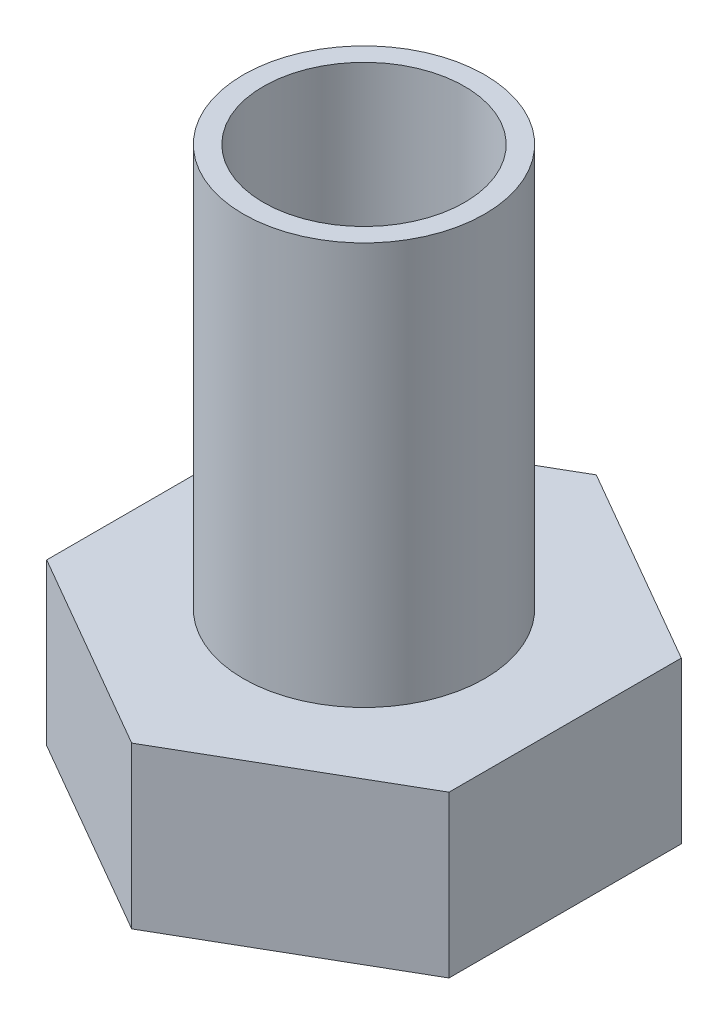
ISO-10303-21;
HEADER;
FILE_DESCRIPTION(('STEP AP214'),'2;1');
FILE_NAME('part.step','',(''),(''),'','','');
FILE_SCHEMA(('AUTOMOTIVE_DESIGN { 1 0 10303 214 1 1 1 1 }'));
ENDSEC;
DATA;
#1=APPLICATION_CONTEXT('core data for automotive mechanical design processes');
#2=APPLICATION_PROTOCOL_DEFINITION('international standard','automotive_design',2000,#1);
#3=PRODUCT_CONTEXT('',#1,'mechanical');
#4=PRODUCT('Part','Part','',(#3));
#5=PRODUCT_RELATED_PRODUCT_CATEGORY('part','',(#4));
#6=PRODUCT_DEFINITION_FORMATION('','',#4);
#7=PRODUCT_DEFINITION_CONTEXT('part definition',#1,'design');
#8=PRODUCT_DEFINITION('design','',#6,#7);
#9=PRODUCT_DEFINITION_SHAPE('','',#8);
#10=(LENGTH_UNIT() NAMED_UNIT(*) SI_UNIT(.MILLI.,.METRE.));
#11=(NAMED_UNIT(*) PLANE_ANGLE_UNIT() SI_UNIT($,.RADIAN.));
#12=(NAMED_UNIT(*) SI_UNIT($,.STERADIAN.) SOLID_ANGLE_UNIT());
#13=UNCERTAINTY_MEASURE_WITH_UNIT(LENGTH_MEASURE(1.E-05),#10,'distance_accuracy_value','');
#14=(GEOMETRIC_REPRESENTATION_CONTEXT(3) GLOBAL_UNCERTAINTY_ASSIGNED_CONTEXT((#13)) GLOBAL_UNIT_ASSIGNED_CONTEXT((#10,
#11,#12)) REPRESENTATION_CONTEXT('',''));
#15=CARTESIAN_POINT('',(0.,0.,0.));
#16=DIRECTION('',(0.,0.,1.));
#17=DIRECTION('',(1.,0.,0.));
#18=AXIS2_PLACEMENT_3D('',#15,#16,#17);
#19=CARTESIAN_POINT('',(0.,10.,0.));
#20=DIRECTION('',(0.,1.,0.));
#21=DIRECTION('',(0.,0.,1.));
#22=AXIS2_PLACEMENT_3D('',#19,#20,#21);
#23=PLANE('',#22);
#24=CARTESIAN_POINT('',(0.,10.,0.));
#25=DIRECTION('',(0.,1.,0.));
#26=DIRECTION('',(0.,0.,1.));
#27=AXIS2_PLACEMENT_3D('',#24,#25,#26);
#28=CIRCLE('',#27,3.);
#29=CARTESIAN_POINT('',(0.,10.,3.));
#30=VERTEX_POINT('',#29);
#31=EDGE_CURVE('E11',#30,#30,#28,.T.);
#32=ORIENTED_EDGE('',*,*,#31,.T.);
#33=EDGE_LOOP('',(#32));
#34=FACE_BOUND('',#33,.T.);
#35=CARTESIAN_POINT('',(0.,10.,0.));
#36=DIRECTION('',(0.,1.,0.));
#37=DIRECTION('',(0.,0.,1.));
#38=AXIS2_PLACEMENT_3D('',#35,#36,#37);
#39=CIRCLE('',#38,2.5);
#40=CARTESIAN_POINT('',(0.,10.,2.5));
#41=VERTEX_POINT('',#40);
#42=EDGE_CURVE('E42',#41,#41,#39,.T.);
#43=ORIENTED_EDGE('',*,*,#42,.F.);
#44=EDGE_LOOP('',(#43));
#45=FACE_BOUND('',#44,.T.);
#46=ADVANCED_FACE('F33',(#34,#45),#23,.T.);
#47=CARTESIAN_POINT('',(0.,10.,0.));
#48=DIRECTION('',(0.,-1.,0.));
#49=DIRECTION('',(0.,0.,-1.));
#50=AXIS2_PLACEMENT_3D('',#47,#48,#49);
#51=CYLINDRICAL_SURFACE('',#50,3.);
#52=ORIENTED_EDGE('',*,*,#31,.F.);
#53=EDGE_LOOP('',(#52));
#54=FACE_BOUND('',#53,.T.);
#55=CARTESIAN_POINT('',(0.,0.,0.));
#56=DIRECTION('',(0.,-1.,0.));
#57=DIRECTION('',(0.,0.,-1.));
#58=AXIS2_PLACEMENT_3D('',#55,#56,#57);
#59=CIRCLE('',#58,3.);
#60=CARTESIAN_POINT('',(0.,0.,-3.));
#61=VERTEX_POINT('',#60);
#62=EDGE_CURVE('E138',#61,#61,#59,.T.);
#63=ORIENTED_EDGE('',*,*,#62,.F.);
#64=EDGE_LOOP('',(#63));
#65=FACE_BOUND('',#64,.T.);
#66=ADVANCED_FACE('F35',(#54,#65),#51,.T.);
#67=CARTESIAN_POINT('',(0.,10.,0.));
#68=DIRECTION('',(0.,-1.,0.));
#69=DIRECTION('',(0.,0.,-1.));
#70=AXIS2_PLACEMENT_3D('',#67,#68,#69);
#71=CYLINDRICAL_SURFACE('',#70,2.5);
#72=ORIENTED_EDGE('',*,*,#42,.T.);
#73=EDGE_LOOP('',(#72));
#74=FACE_BOUND('',#73,.T.);
#75=CARTESIAN_POINT('',(0.,0.,0.));
#76=DIRECTION('',(0.,1.,0.));
#77=DIRECTION('',(0.,0.,1.));
#78=AXIS2_PLACEMENT_3D('',#75,#76,#77);
#79=CIRCLE('',#78,2.5);
#80=CARTESIAN_POINT('',(0.,0.,2.5));
#81=VERTEX_POINT('',#80);
#82=EDGE_CURVE('E141',#81,#81,#79,.T.);
#83=ORIENTED_EDGE('',*,*,#82,.F.);
#84=EDGE_LOOP('',(#83));
#85=FACE_BOUND('',#84,.T.);
#86=ADVANCED_FACE('F148',(#74,#85),#71,.F.);
#87=CARTESIAN_POINT('',(0.,0.,0.));
#88=DIRECTION('',(0.,-1.,0.));
#89=DIRECTION('',(0.,0.,-1.));
#90=AXIS2_PLACEMENT_3D('',#87,#88,#89);
#91=PLANE('',#90);
#92=ORIENTED_EDGE('',*,*,#82,.T.);
#93=EDGE_LOOP('',(#92));
#94=FACE_BOUND('',#93,.T.);
#95=ADVANCED_FACE('F146',(#94),#91,.F.);
#96=DIRECTION('',(-0.866025403784439,0.,0.5));
#97=VECTOR('',#96,1.);
#98=CARTESIAN_POINT('',(4.99999999999999,0.,2.88675134594813));
#99=LINE('',#98,#97);
#100=CARTESIAN_POINT('',(4.99999999999999,0.,2.88675134594813));
#101=VERTEX_POINT('',#100);
#102=CARTESIAN_POINT('',(0.,0.,5.77350269189626));
#103=VERTEX_POINT('',#102);
#104=EDGE_CURVE('E119',#101,#103,#99,.T.);
#105=ORIENTED_EDGE('',*,*,#104,.F.);
#106=DIRECTION('',(0.,0.,1.));
#107=VECTOR('',#106,1.);
#108=CARTESIAN_POINT('',(5.,0.,-2.88675134594813));
#109=LINE('',#108,#107);
#110=CARTESIAN_POINT('',(5.,0.,-2.88675134594813));
#111=VERTEX_POINT('',#110);
#112=EDGE_CURVE('E79',#111,#101,#109,.T.);
#113=ORIENTED_EDGE('',*,*,#112,.F.);
#114=DIRECTION('',(0.866025403784439,0.,0.5));
#115=VECTOR('',#114,1.);
#116=CARTESIAN_POINT('',(0.,0.,-5.77350269189626));
#117=LINE('',#116,#115);
#118=CARTESIAN_POINT('',(0.,0.,-5.77350269189626));
#119=VERTEX_POINT('',#118);
#120=EDGE_CURVE('E73',#119,#111,#117,.T.);
#121=ORIENTED_EDGE('',*,*,#120,.F.);
#122=DIRECTION('',(0.866025403784439,0.,-0.5));
#123=VECTOR('',#122,1.);
#124=CARTESIAN_POINT('',(-5.,0.,-2.88675134594813));
#125=LINE('',#124,#123);
#126=CARTESIAN_POINT('',(-5.,0.,-2.88675134594813));
#127=VERTEX_POINT('',#126);
#128=EDGE_CURVE('E109',#127,#119,#125,.T.);
#129=ORIENTED_EDGE('',*,*,#128,.F.);
#130=DIRECTION('',(0.,0.,-1.));
#131=VECTOR('',#130,1.);
#132=CARTESIAN_POINT('',(-5.,0.,2.88675134594813));
#133=LINE('',#132,#131);
#134=CARTESIAN_POINT('',(-5.,0.,2.88675134594813));
#135=VERTEX_POINT('',#134);
#136=EDGE_CURVE('E124',#135,#127,#133,.T.);
#137=ORIENTED_EDGE('',*,*,#136,.F.);
#138=DIRECTION('',(-0.866025403784439,0.,-0.5));
#139=VECTOR('',#138,1.);
#140=CARTESIAN_POINT('',(0.,0.,5.77350269189626));
#141=LINE('',#140,#139);
#142=EDGE_CURVE('E122',#103,#135,#141,.T.);
#143=ORIENTED_EDGE('',*,*,#142,.F.);
#144=EDGE_LOOP('',(#105,#113,#121,#129,#137,#143));
#145=FACE_BOUND('',#144,.T.);
#146=ORIENTED_EDGE('',*,*,#62,.T.);
#147=EDGE_LOOP('',(#146));
#148=FACE_BOUND('',#147,.T.);
#149=ADVANCED_FACE('F156',(#145,#148),#91,.F.);
#150=CARTESIAN_POINT('',(4.99999999999999,-4.,2.88675134594813));
#151=DIRECTION('',(-0.5,0.,-0.866025403784439));
#152=DIRECTION('',(-0.866025403784439,0.,0.5));
#153=AXIS2_PLACEMENT_3D('',#150,#151,#152);
#154=PLANE('',#153);
#155=ORIENTED_EDGE('',*,*,#104,.T.);
#156=DIRECTION('',(0.,1.,0.));
#157=VECTOR('',#156,1.);
#158=CARTESIAN_POINT('',(0.,-4.,5.77350269189626));
#159=LINE('',#158,#157);
#160=CARTESIAN_POINT('',(0.,-4.,5.77350269189626));
#161=VERTEX_POINT('',#160);
#162=EDGE_CURVE('E136',#161,#103,#159,.T.);
#163=ORIENTED_EDGE('',*,*,#162,.F.);
#164=DIRECTION('',(-0.866025403784439,0.,0.5));
#165=VECTOR('',#164,1.);
#166=CARTESIAN_POINT('',(4.99999999999999,-4.,2.88675134594813));
#167=LINE('',#166,#165);
#168=CARTESIAN_POINT('',(4.99999999999999,-4.,2.88675134594813));
#169=VERTEX_POINT('',#168);
#170=EDGE_CURVE('E129',#169,#161,#167,.T.);
#171=ORIENTED_EDGE('',*,*,#170,.F.);
#172=DIRECTION('',(0.,1.,0.));
#173=VECTOR('',#172,1.);
#174=CARTESIAN_POINT('',(4.99999999999999,-4.,2.88675134594813));
#175=LINE('',#174,#173);
#176=EDGE_CURVE('E115',#169,#101,#175,.T.);
#177=ORIENTED_EDGE('',*,*,#176,.T.);
#178=EDGE_LOOP('',(#155,#163,#171,#177));
#179=FACE_BOUND('',#178,.T.);
#180=ADVANCED_FACE('F171',(#179),#154,.F.);
#181=CARTESIAN_POINT('',(0.,-4.,5.77350269189626));
#182=DIRECTION('',(0.5,0.,-0.866025403784439));
#183=DIRECTION('',(-0.866025403784439,0.,-0.5));
#184=AXIS2_PLACEMENT_3D('',#181,#182,#183);
#185=PLANE('',#184);
#186=ORIENTED_EDGE('',*,*,#142,.T.);
#187=DIRECTION('',(0.,1.,0.));
#188=VECTOR('',#187,1.);
#189=CARTESIAN_POINT('',(-5.,-4.,2.88675134594813));
#190=LINE('',#189,#188);
#191=CARTESIAN_POINT('',(-5.,-4.,2.88675134594813));
#192=VERTEX_POINT('',#191);
#193=EDGE_CURVE('E133',#192,#135,#190,.T.);
#194=ORIENTED_EDGE('',*,*,#193,.F.);
#195=DIRECTION('',(-0.866025403784439,0.,-0.5));
#196=VECTOR('',#195,1.);
#197=CARTESIAN_POINT('',(0.,-4.,5.77350269189626));
#198=LINE('',#197,#196);
#199=EDGE_CURVE('E88',#161,#192,#198,.T.);
#200=ORIENTED_EDGE('',*,*,#199,.F.);
#201=ORIENTED_EDGE('',*,*,#162,.T.);
#202=EDGE_LOOP('',(#186,#194,#200,#201));
#203=FACE_BOUND('',#202,.T.);
#204=ADVANCED_FACE('F176',(#203),#185,.F.);
#205=CARTESIAN_POINT('',(-5.,-4.,2.88675134594813));
#206=DIRECTION('',(1.,0.,0.));
#207=DIRECTION('',(0.,0.,-1.));
#208=AXIS2_PLACEMENT_3D('',#205,#206,#207);
#209=PLANE('',#208);
#210=ORIENTED_EDGE('',*,*,#136,.T.);
#211=DIRECTION('',(0.,1.,0.));
#212=VECTOR('',#211,1.);
#213=CARTESIAN_POINT('',(-5.,-4.,-2.88675134594813));
#214=LINE('',#213,#212);
#215=CARTESIAN_POINT('',(-5.,-4.,-2.88675134594813));
#216=VERTEX_POINT('',#215);
#217=EDGE_CURVE('E110',#216,#127,#214,.T.);
#218=ORIENTED_EDGE('',*,*,#217,.F.);
#219=DIRECTION('',(0.,0.,-1.));
#220=VECTOR('',#219,1.);
#221=CARTESIAN_POINT('',(-5.,-4.,2.88675134594813));
#222=LINE('',#221,#220);
#223=EDGE_CURVE('E101',#192,#216,#222,.T.);
#224=ORIENTED_EDGE('',*,*,#223,.F.);
#225=ORIENTED_EDGE('',*,*,#193,.T.);
#226=EDGE_LOOP('',(#210,#218,#224,#225));
#227=FACE_BOUND('',#226,.T.);
#228=ADVANCED_FACE('F188',(#227),#209,.F.);
#229=CARTESIAN_POINT('',(-5.,-4.,-2.88675134594813));
#230=DIRECTION('',(0.5,0.,0.866025403784439));
#231=DIRECTION('',(0.866025403784439,0.,-0.5));
#232=AXIS2_PLACEMENT_3D('',#229,#230,#231);
#233=PLANE('',#232);
#234=ORIENTED_EDGE('',*,*,#128,.T.);
#235=DIRECTION('',(0.,1.,0.));
#236=VECTOR('',#235,1.);
#237=CARTESIAN_POINT('',(0.,-4.,-5.77350269189626));
#238=LINE('',#237,#236);
#239=CARTESIAN_POINT('',(0.,-4.,-5.77350269189626));
#240=VERTEX_POINT('',#239);
#241=EDGE_CURVE('E106',#240,#119,#238,.T.);
#242=ORIENTED_EDGE('',*,*,#241,.F.);
#243=DIRECTION('',(0.866025403784439,0.,-0.5));
#244=VECTOR('',#243,1.);
#245=CARTESIAN_POINT('',(-5.,-4.,-2.88675134594813));
#246=LINE('',#245,#244);
#247=EDGE_CURVE('E95',#216,#240,#246,.T.);
#248=ORIENTED_EDGE('',*,*,#247,.F.);
#249=ORIENTED_EDGE('',*,*,#217,.T.);
#250=EDGE_LOOP('',(#234,#242,#248,#249));
#251=FACE_BOUND('',#250,.T.);
#252=ADVANCED_FACE('F107',(#251),#233,.F.);
#253=CARTESIAN_POINT('',(0.,-4.,-5.77350269189626));
#254=DIRECTION('',(-0.5,0.,0.866025403784439));
#255=DIRECTION('',(0.866025403784439,0.,0.5));
#256=AXIS2_PLACEMENT_3D('',#253,#254,#255);
#257=PLANE('',#256);
#258=ORIENTED_EDGE('',*,*,#120,.T.);
#259=DIRECTION('',(0.,1.,0.));
#260=VECTOR('',#259,1.);
#261=CARTESIAN_POINT('',(5.,-4.,-2.88675134594813));
#262=LINE('',#261,#260);
#263=CARTESIAN_POINT('',(5.,-4.,-2.88675134594813));
#264=VERTEX_POINT('',#263);
#265=EDGE_CURVE('E111',#264,#111,#262,.T.);
#266=ORIENTED_EDGE('',*,*,#265,.F.);
#267=DIRECTION('',(0.866025403784439,0.,0.5));
#268=VECTOR('',#267,1.);
#269=CARTESIAN_POINT('',(0.,-4.,-5.77350269189626));
#270=LINE('',#269,#268);
#271=EDGE_CURVE('E99',#240,#264,#270,.T.);
#272=ORIENTED_EDGE('',*,*,#271,.F.);
#273=ORIENTED_EDGE('',*,*,#241,.T.);
#274=EDGE_LOOP('',(#258,#266,#272,#273));
#275=FACE_BOUND('',#274,.T.);
#276=ADVANCED_FACE('F113',(#275),#257,.F.);
#277=CARTESIAN_POINT('',(5.,-4.,-2.88675134594813));
#278=DIRECTION('',(-1.,0.,0.));
#279=DIRECTION('',(0.,0.,1.));
#280=AXIS2_PLACEMENT_3D('',#277,#278,#279);
#281=PLANE('',#280);
#282=ORIENTED_EDGE('',*,*,#112,.T.);
#283=ORIENTED_EDGE('',*,*,#176,.F.);
#284=DIRECTION('',(0.,0.,1.));
#285=VECTOR('',#284,1.);
#286=CARTESIAN_POINT('',(5.,-4.,-2.88675134594813));
#287=LINE('',#286,#285);
#288=EDGE_CURVE('E50',#264,#169,#287,.T.);
#289=ORIENTED_EDGE('',*,*,#288,.F.);
#290=ORIENTED_EDGE('',*,*,#265,.T.);
#291=EDGE_LOOP('',(#282,#283,#289,#290));
#292=FACE_BOUND('',#291,.T.);
#293=ADVANCED_FACE('F181',(#292),#281,.F.);
#294=CARTESIAN_POINT('',(0.,-4.,0.));
#295=DIRECTION('',(0.,-1.,0.));
#296=DIRECTION('',(0.,0.,-1.));
#297=AXIS2_PLACEMENT_3D('',#294,#295,#296);
#298=PLANE('',#297);
#299=ORIENTED_EDGE('',*,*,#170,.T.);
#300=ORIENTED_EDGE('',*,*,#199,.T.);
#301=ORIENTED_EDGE('',*,*,#223,.T.);
#302=ORIENTED_EDGE('',*,*,#247,.T.);
#303=ORIENTED_EDGE('',*,*,#271,.T.);
#304=ORIENTED_EDGE('',*,*,#288,.T.);
#305=EDGE_LOOP('',(#299,#300,#301,#302,#303,#304));
#306=FACE_BOUND('',#305,.T.);
#307=ADVANCED_FACE('F97',(#306),#298,.T.);
#308=CLOSED_SHELL('',(#46,#66,#86,#95,#149,#180,#204,#228,#252,#276,#293,#307));
#309=MANIFOLD_SOLID_BREP('B2',#308);
#310=ADVANCED_BREP_SHAPE_REPRESENTATION('',(#18,#309),#14);
#311=SHAPE_DEFINITION_REPRESENTATION(#9,#310);
ENDSEC;
END-ISO-10303-21;
